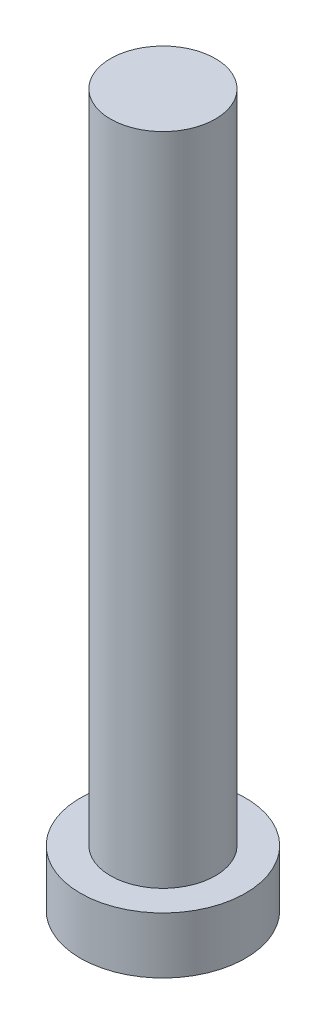
ISO-10303-21;
HEADER;
FILE_DESCRIPTION(('STEP AP214'),'2;1');
FILE_NAME('part.step','',(''),(''),'','','');
FILE_SCHEMA(('AUTOMOTIVE_DESIGN { 1 0 10303 214 1 1 1 1 }'));
ENDSEC;
DATA;
#1=APPLICATION_CONTEXT('core data for automotive mechanical design processes');
#2=APPLICATION_PROTOCOL_DEFINITION('international standard','automotive_design',2000,#1);
#3=PRODUCT_CONTEXT('',#1,'mechanical');
#4=PRODUCT('Part','Part','',(#3));
#5=PRODUCT_RELATED_PRODUCT_CATEGORY('part','',(#4));
#6=PRODUCT_DEFINITION_FORMATION('','',#4);
#7=PRODUCT_DEFINITION_CONTEXT('part definition',#1,'design');
#8=PRODUCT_DEFINITION('design','',#6,#7);
#9=PRODUCT_DEFINITION_SHAPE('','',#8);
#10=(LENGTH_UNIT() NAMED_UNIT(*) SI_UNIT(.MILLI.,.METRE.));
#11=(NAMED_UNIT(*) PLANE_ANGLE_UNIT() SI_UNIT($,.RADIAN.));
#12=(NAMED_UNIT(*) SI_UNIT($,.STERADIAN.) SOLID_ANGLE_UNIT());
#13=UNCERTAINTY_MEASURE_WITH_UNIT(LENGTH_MEASURE(1.E-05),#10,'distance_accuracy_value','');
#14=(GEOMETRIC_REPRESENTATION_CONTEXT(3) GLOBAL_UNCERTAINTY_ASSIGNED_CONTEXT((#13)) GLOBAL_UNIT_ASSIGNED_CONTEXT((#10,
#11,#12)) REPRESENTATION_CONTEXT('',''));
#15=CARTESIAN_POINT('',(0.,0.,0.));
#16=DIRECTION('',(0.,0.,1.));
#17=DIRECTION('',(1.,0.,0.));
#18=AXIS2_PLACEMENT_3D('',#15,#16,#17);
#19=CARTESIAN_POINT('',(0.,0.,0.));
#20=DIRECTION('',(0.,1.,0.));
#21=DIRECTION('',(0.,0.,1.));
#22=AXIS2_PLACEMENT_3D('',#19,#20,#21);
#23=PLANE('',#22);
#24=CARTESIAN_POINT('',(0.,0.,0.));
#25=DIRECTION('',(0.,1.,0.));
#26=DIRECTION('',(0.,0.,1.));
#27=AXIS2_PLACEMENT_3D('',#24,#25,#26);
#28=CIRCLE('',#27,3.15);
#29=CARTESIAN_POINT('',(0.,0.,3.15));
#30=VERTEX_POINT('',#29);
#31=EDGE_CURVE('E39',#30,#30,#28,.T.);
#32=ORIENTED_EDGE('',*,*,#31,.F.);
#33=EDGE_LOOP('',(#32));
#34=FACE_BOUND('',#33,.T.);
#35=CARTESIAN_POINT('',(1.,0.,1.));
#36=DIRECTION('',(0.,1.,0.));
#37=DIRECTION('',(0.,0.,-1.));
#38=AXIS2_PLACEMENT_3D('',#35,#36,#37);
#39=CIRCLE('',#38,0.5);
#40=CARTESIAN_POINT('',(1.,0.,0.5));
#41=VERTEX_POINT('',#40);
#42=CARTESIAN_POINT('',(0.5,0.,1.));
#43=VERTEX_POINT('',#42);
#44=EDGE_CURVE('E186',#41,#43,#39,.T.);
#45=ORIENTED_EDGE('',*,*,#44,.F.);
#46=DIRECTION('',(-1.,0.,0.));
#47=VECTOR('',#46,1.);
#48=CARTESIAN_POINT('',(1.,0.,0.5));
#49=LINE('',#48,#47);
#50=CARTESIAN_POINT('',(2.,0.,0.5));
#51=VERTEX_POINT('',#50);
#52=EDGE_CURVE('E52',#51,#41,#49,.T.);
#53=ORIENTED_EDGE('',*,*,#52,.F.);
#54=DIRECTION('',(0.,0.,1.));
#55=VECTOR('',#54,1.);
#56=CARTESIAN_POINT('',(2.,0.,-0.5));
#57=LINE('',#56,#55);
#58=CARTESIAN_POINT('',(2.,0.,-0.5));
#59=VERTEX_POINT('',#58);
#60=EDGE_CURVE('E225',#59,#51,#57,.T.);
#61=ORIENTED_EDGE('',*,*,#60,.F.);
#62=DIRECTION('',(1.,0.,0.));
#63=VECTOR('',#62,1.);
#64=CARTESIAN_POINT('',(1.,0.,-0.5));
#65=LINE('',#64,#63);
#66=CARTESIAN_POINT('',(1.,0.,-0.5));
#67=VERTEX_POINT('',#66);
#68=EDGE_CURVE('E223',#67,#59,#65,.T.);
#69=ORIENTED_EDGE('',*,*,#68,.F.);
#70=CARTESIAN_POINT('',(1.,0.,-1.));
#71=DIRECTION('',(0.,1.,0.));
#72=DIRECTION('',(0.,0.,-1.));
#73=AXIS2_PLACEMENT_3D('',#70,#71,#72);
#74=CIRCLE('',#73,0.5);
#75=CARTESIAN_POINT('',(0.500000000000001,0.,-1.));
#76=VERTEX_POINT('',#75);
#77=EDGE_CURVE('E160',#76,#67,#74,.T.);
#78=ORIENTED_EDGE('',*,*,#77,.F.);
#79=DIRECTION('',(0.,0.,1.));
#80=VECTOR('',#79,1.);
#81=CARTESIAN_POINT('',(0.500000000000001,0.,-2.));
#82=LINE('',#81,#80);
#83=CARTESIAN_POINT('',(0.500000000000001,0.,-2.));
#84=VERTEX_POINT('',#83);
#85=EDGE_CURVE('E219',#84,#76,#82,.T.);
#86=ORIENTED_EDGE('',*,*,#85,.F.);
#87=DIRECTION('',(1.,0.,0.));
#88=VECTOR('',#87,1.);
#89=CARTESIAN_POINT('',(-0.5,0.,-2.));
#90=LINE('',#89,#88);
#91=CARTESIAN_POINT('',(-0.5,0.,-2.));
#92=VERTEX_POINT('',#91);
#93=EDGE_CURVE('E216',#92,#84,#90,.T.);
#94=ORIENTED_EDGE('',*,*,#93,.F.);
#95=DIRECTION('',(0.,0.,-1.));
#96=VECTOR('',#95,1.);
#97=CARTESIAN_POINT('',(-0.5,0.,-2.));
#98=LINE('',#97,#96);
#99=CARTESIAN_POINT('',(-0.5,0.,-1.));
#100=VERTEX_POINT('',#99);
#101=EDGE_CURVE('E213',#100,#92,#98,.T.);
#102=ORIENTED_EDGE('',*,*,#101,.F.);
#103=CARTESIAN_POINT('',(-1.,0.,-1.));
#104=DIRECTION('',(0.,1.,0.));
#105=DIRECTION('',(0.,0.,-1.));
#106=AXIS2_PLACEMENT_3D('',#103,#104,#105);
#107=CIRCLE('',#106,0.5);
#108=CARTESIAN_POINT('',(-1.,0.,-0.5));
#109=VERTEX_POINT('',#108);
#110=EDGE_CURVE('E210',#109,#100,#107,.T.);
#111=ORIENTED_EDGE('',*,*,#110,.F.);
#112=DIRECTION('',(1.,0.,0.));
#113=VECTOR('',#112,1.);
#114=CARTESIAN_POINT('',(-2.,0.,-0.5));
#115=LINE('',#114,#113);
#116=CARTESIAN_POINT('',(-2.,0.,-0.5));
#117=VERTEX_POINT('',#116);
#118=EDGE_CURVE('E207',#117,#109,#115,.T.);
#119=ORIENTED_EDGE('',*,*,#118,.F.);
#120=DIRECTION('',(0.,0.,-1.));
#121=VECTOR('',#120,1.);
#122=CARTESIAN_POINT('',(-2.,0.,-0.5));
#123=LINE('',#122,#121);
#124=CARTESIAN_POINT('',(-2.,0.,0.5));
#125=VERTEX_POINT('',#124);
#126=EDGE_CURVE('E204',#125,#117,#123,.T.);
#127=ORIENTED_EDGE('',*,*,#126,.F.);
#128=DIRECTION('',(-1.,0.,0.));
#129=VECTOR('',#128,1.);
#130=CARTESIAN_POINT('',(-2.,0.,0.5));
#131=LINE('',#130,#129);
#132=CARTESIAN_POINT('',(-1.,0.,0.5));
#133=VERTEX_POINT('',#132);
#134=EDGE_CURVE('E201',#133,#125,#131,.T.);
#135=ORIENTED_EDGE('',*,*,#134,.F.);
#136=CARTESIAN_POINT('',(-1.,0.,1.));
#137=DIRECTION('',(0.,1.,0.));
#138=DIRECTION('',(0.,0.,1.));
#139=AXIS2_PLACEMENT_3D('',#136,#137,#138);
#140=CIRCLE('',#139,0.5);
#141=CARTESIAN_POINT('',(-0.5,0.,1.));
#142=VERTEX_POINT('',#141);
#143=EDGE_CURVE('E198',#142,#133,#140,.T.);
#144=ORIENTED_EDGE('',*,*,#143,.F.);
#145=DIRECTION('',(0.,0.,-1.));
#146=VECTOR('',#145,1.);
#147=CARTESIAN_POINT('',(-0.5,0.,1.));
#148=LINE('',#147,#146);
#149=CARTESIAN_POINT('',(-0.5,0.,2.));
#150=VERTEX_POINT('',#149);
#151=EDGE_CURVE('E195',#150,#142,#148,.T.);
#152=ORIENTED_EDGE('',*,*,#151,.F.);
#153=DIRECTION('',(-1.,0.,0.));
#154=VECTOR('',#153,1.);
#155=CARTESIAN_POINT('',(-0.5,0.,2.));
#156=LINE('',#155,#154);
#157=CARTESIAN_POINT('',(0.500000000000001,0.,2.));
#158=VERTEX_POINT('',#157);
#159=EDGE_CURVE('E192',#158,#150,#156,.T.);
#160=ORIENTED_EDGE('',*,*,#159,.F.);
#161=DIRECTION('',(0.,0.,1.));
#162=VECTOR('',#161,1.);
#163=CARTESIAN_POINT('',(0.5,0.,1.));
#164=LINE('',#163,#162);
#165=EDGE_CURVE('E189',#43,#158,#164,.T.);
#166=ORIENTED_EDGE('',*,*,#165,.F.);
#167=EDGE_LOOP('',(#45,#53,#61,#69,#78,#86,#94,#102,#111,#119,#127,#135,#144,#152,#160,#166));
#168=FACE_BOUND('',#167,.T.);
#169=ADVANCED_FACE('F35',(#34,#168),#23,.F.);
#170=CARTESIAN_POINT('',(0.,2.15,0.));
#171=DIRECTION('',(0.,-1.,0.));
#172=DIRECTION('',(0.,0.,-1.));
#173=AXIS2_PLACEMENT_3D('',#170,#171,#172);
#174=CYLINDRICAL_SURFACE('',#173,3.15);
#175=CARTESIAN_POINT('',(0.,2.15,0.));
#176=DIRECTION('',(0.,1.,0.));
#177=DIRECTION('',(0.,0.,1.));
#178=AXIS2_PLACEMENT_3D('',#175,#176,#177);
#179=CIRCLE('',#178,3.15);
#180=CARTESIAN_POINT('',(0.,2.15,3.15));
#181=VERTEX_POINT('',#180);
#182=EDGE_CURVE('E44',#181,#181,#179,.T.);
#183=ORIENTED_EDGE('',*,*,#182,.F.);
#184=EDGE_LOOP('',(#183));
#185=FACE_BOUND('',#184,.T.);
#186=ORIENTED_EDGE('',*,*,#31,.T.);
#187=EDGE_LOOP('',(#186));
#188=FACE_BOUND('',#187,.T.);
#189=ADVANCED_FACE('F37',(#185,#188),#174,.T.);
#190=CARTESIAN_POINT('',(0.,2.15,0.));
#191=DIRECTION('',(0.,1.,0.));
#192=DIRECTION('',(0.,0.,1.));
#193=AXIS2_PLACEMENT_3D('',#190,#191,#192);
#194=PLANE('',#193);
#195=CARTESIAN_POINT('',(0.,2.15,0.));
#196=DIRECTION('',(0.,1.,0.));
#197=DIRECTION('',(0.,0.,1.));
#198=AXIS2_PLACEMENT_3D('',#195,#196,#197);
#199=CIRCLE('',#198,2.);
#200=CARTESIAN_POINT('',(0.,2.15,2.));
#201=VERTEX_POINT('',#200);
#202=EDGE_CURVE('E11',#201,#201,#199,.T.);
#203=ORIENTED_EDGE('',*,*,#202,.F.);
#204=EDGE_LOOP('',(#203));
#205=FACE_BOUND('',#204,.T.);
#206=ORIENTED_EDGE('',*,*,#182,.T.);
#207=EDGE_LOOP('',(#206));
#208=FACE_BOUND('',#207,.T.);
#209=ADVANCED_FACE('F374',(#205,#208),#194,.T.);
#210=CARTESIAN_POINT('',(0.,27.15,0.));
#211=DIRECTION('',(0.,-1.,0.));
#212=DIRECTION('',(0.,0.,-1.));
#213=AXIS2_PLACEMENT_3D('',#210,#211,#212);
#214=CYLINDRICAL_SURFACE('',#213,2.);
#215=CARTESIAN_POINT('',(0.,27.15,0.));
#216=DIRECTION('',(0.,1.,0.));
#217=DIRECTION('',(0.,0.,1.));
#218=AXIS2_PLACEMENT_3D('',#215,#216,#217);
#219=CIRCLE('',#218,2.);
#220=CARTESIAN_POINT('',(0.,27.15,2.));
#221=VERTEX_POINT('',#220);
#222=EDGE_CURVE('E229',#221,#221,#219,.T.);
#223=ORIENTED_EDGE('',*,*,#222,.F.);
#224=EDGE_LOOP('',(#223));
#225=FACE_BOUND('',#224,.T.);
#226=ORIENTED_EDGE('',*,*,#202,.T.);
#227=EDGE_LOOP('',(#226));
#228=FACE_BOUND('',#227,.T.);
#229=ADVANCED_FACE('F370',(#225,#228),#214,.T.);
#230=CARTESIAN_POINT('',(0.,27.15,0.));
#231=DIRECTION('',(0.,1.,0.));
#232=DIRECTION('',(0.,0.,1.));
#233=AXIS2_PLACEMENT_3D('',#230,#231,#232);
#234=PLANE('',#233);
#235=ORIENTED_EDGE('',*,*,#222,.T.);
#236=EDGE_LOOP('',(#235));
#237=FACE_BOUND('',#236,.T.);
#238=ADVANCED_FACE('F320',(#237),#234,.T.);
#239=CARTESIAN_POINT('',(1.,1.5,0.5));
#240=DIRECTION('',(0.,0.,1.));
#241=DIRECTION('',(1.,0.,0.));
#242=AXIS2_PLACEMENT_3D('',#239,#240,#241);
#243=PLANE('',#242);
#244=ORIENTED_EDGE('',*,*,#52,.T.);
#245=DIRECTION('',(0.,-1.,0.));
#246=VECTOR('',#245,1.);
#247=CARTESIAN_POINT('',(1.,1.5,0.5));
#248=LINE('',#247,#246);
#249=CARTESIAN_POINT('',(1.,1.5,0.5));
#250=VERTEX_POINT('',#249);
#251=EDGE_CURVE('E112',#250,#41,#248,.T.);
#252=ORIENTED_EDGE('',*,*,#251,.F.);
#253=DIRECTION('',(-1.,0.,0.));
#254=VECTOR('',#253,1.);
#255=CARTESIAN_POINT('',(1.,1.5,0.5));
#256=LINE('',#255,#254);
#257=CARTESIAN_POINT('',(2.,1.5,0.5));
#258=VERTEX_POINT('',#257);
#259=EDGE_CURVE('E227',#258,#250,#256,.T.);
#260=ORIENTED_EDGE('',*,*,#259,.F.);
#261=DIRECTION('',(0.,-1.,0.));
#262=VECTOR('',#261,1.);
#263=CARTESIAN_POINT('',(2.,1.5,0.5));
#264=LINE('',#263,#262);
#265=EDGE_CURVE('E60',#258,#51,#264,.T.);
#266=ORIENTED_EDGE('',*,*,#265,.T.);
#267=EDGE_LOOP('',(#244,#252,#260,#266));
#268=FACE_BOUND('',#267,.T.);
#269=ADVANCED_FACE('F313',(#268),#243,.F.);
#270=CARTESIAN_POINT('',(2.,1.5,-0.5));
#271=DIRECTION('',(1.,0.,0.));
#272=DIRECTION('',(0.,0.,-1.));
#273=AXIS2_PLACEMENT_3D('',#270,#271,#272);
#274=PLANE('',#273);
#275=ORIENTED_EDGE('',*,*,#60,.T.);
#276=ORIENTED_EDGE('',*,*,#265,.F.);
#277=DIRECTION('',(0.,0.,1.));
#278=VECTOR('',#277,1.);
#279=CARTESIAN_POINT('',(2.,1.5,-0.5));
#280=LINE('',#279,#278);
#281=CARTESIAN_POINT('',(2.,1.5,-0.5));
#282=VERTEX_POINT('',#281);
#283=EDGE_CURVE('E172',#282,#258,#280,.T.);
#284=ORIENTED_EDGE('',*,*,#283,.F.);
#285=DIRECTION('',(0.,-1.,0.));
#286=VECTOR('',#285,1.);
#287=CARTESIAN_POINT('',(2.,1.5,-0.5));
#288=LINE('',#287,#286);
#289=EDGE_CURVE('E164',#282,#59,#288,.T.);
#290=ORIENTED_EDGE('',*,*,#289,.T.);
#291=EDGE_LOOP('',(#275,#276,#284,#290));
#292=FACE_BOUND('',#291,.T.);
#293=ADVANCED_FACE('F311',(#292),#274,.F.);
#294=CARTESIAN_POINT('',(1.,1.5,-0.5));
#295=DIRECTION('',(0.,0.,-1.));
#296=DIRECTION('',(-1.,0.,0.));
#297=AXIS2_PLACEMENT_3D('',#294,#295,#296);
#298=PLANE('',#297);
#299=ORIENTED_EDGE('',*,*,#68,.T.);
#300=ORIENTED_EDGE('',*,*,#289,.F.);
#301=DIRECTION('',(1.,0.,0.));
#302=VECTOR('',#301,1.);
#303=CARTESIAN_POINT('',(1.,1.5,-0.5));
#304=LINE('',#303,#302);
#305=CARTESIAN_POINT('',(1.,1.5,-0.5));
#306=VERTEX_POINT('',#305);
#307=EDGE_CURVE('E168',#306,#282,#304,.T.);
#308=ORIENTED_EDGE('',*,*,#307,.F.);
#309=DIRECTION('',(0.,-1.,0.));
#310=VECTOR('',#309,1.);
#311=CARTESIAN_POINT('',(1.,1.5,-0.5));
#312=LINE('',#311,#310);
#313=EDGE_CURVE('E153',#306,#67,#312,.T.);
#314=ORIENTED_EDGE('',*,*,#313,.T.);
#315=EDGE_LOOP('',(#299,#300,#308,#314));
#316=FACE_BOUND('',#315,.T.);
#317=ADVANCED_FACE('F169',(#316),#298,.F.);
#318=CARTESIAN_POINT('',(1.,1.5,-1.));
#319=DIRECTION('',(0.,-1.,0.));
#320=DIRECTION('',(0.,0.,-1.));
#321=AXIS2_PLACEMENT_3D('',#318,#319,#320);
#322=CYLINDRICAL_SURFACE('',#321,0.5);
#323=ORIENTED_EDGE('',*,*,#77,.T.);
#324=ORIENTED_EDGE('',*,*,#313,.F.);
#325=CARTESIAN_POINT('',(1.,1.5,-1.));
#326=DIRECTION('',(0.,1.,0.));
#327=DIRECTION('',(0.,0.,-1.));
#328=AXIS2_PLACEMENT_3D('',#325,#326,#327);
#329=CIRCLE('',#328,0.5);
#330=CARTESIAN_POINT('',(0.500000000000001,1.5,-1.));
#331=VERTEX_POINT('',#330);
#332=EDGE_CURVE('E157',#331,#306,#329,.T.);
#333=ORIENTED_EDGE('',*,*,#332,.F.);
#334=DIRECTION('',(0.,-1.,0.));
#335=VECTOR('',#334,1.);
#336=CARTESIAN_POINT('',(0.500000000000001,1.5,-1.));
#337=LINE('',#336,#335);
#338=EDGE_CURVE('E165',#331,#76,#337,.T.);
#339=ORIENTED_EDGE('',*,*,#338,.T.);
#340=EDGE_LOOP('',(#323,#324,#333,#339));
#341=FACE_BOUND('',#340,.T.);
#342=ADVANCED_FACE('F155',(#341),#322,.T.);
#343=CARTESIAN_POINT('',(0.500000000000001,1.5,-2.));
#344=DIRECTION('',(1.,0.,0.));
#345=DIRECTION('',(0.,0.,-1.));
#346=AXIS2_PLACEMENT_3D('',#343,#344,#345);
#347=PLANE('',#346);
#348=ORIENTED_EDGE('',*,*,#85,.T.);
#349=ORIENTED_EDGE('',*,*,#338,.F.);
#350=DIRECTION('',(0.,0.,1.));
#351=VECTOR('',#350,1.);
#352=CARTESIAN_POINT('',(0.500000000000001,1.5,-2.));
#353=LINE('',#352,#351);
#354=CARTESIAN_POINT('',(0.500000000000001,1.5,-2.));
#355=VERTEX_POINT('',#354);
#356=EDGE_CURVE('E178',#355,#331,#353,.T.);
#357=ORIENTED_EDGE('',*,*,#356,.F.);
#358=DIRECTION('',(0.,-1.,0.));
#359=VECTOR('',#358,1.);
#360=CARTESIAN_POINT('',(0.500000000000001,1.5,-2.));
#361=LINE('',#360,#359);
#362=EDGE_CURVE('E232',#355,#84,#361,.T.);
#363=ORIENTED_EDGE('',*,*,#362,.T.);
#364=EDGE_LOOP('',(#348,#349,#357,#363));
#365=FACE_BOUND('',#364,.T.);
#366=ADVANCED_FACE('F310',(#365),#347,.F.);
#367=CARTESIAN_POINT('',(-0.5,1.5,-2.));
#368=DIRECTION('',(0.,0.,-1.));
#369=DIRECTION('',(-1.,0.,0.));
#370=AXIS2_PLACEMENT_3D('',#367,#368,#369);
#371=PLANE('',#370);
#372=ORIENTED_EDGE('',*,*,#93,.T.);
#373=ORIENTED_EDGE('',*,*,#362,.F.);
#374=DIRECTION('',(1.,0.,0.));
#375=VECTOR('',#374,1.);
#376=CARTESIAN_POINT('',(-0.5,1.5,-2.));
#377=LINE('',#376,#375);
#378=CARTESIAN_POINT('',(-0.5,1.5,-2.));
#379=VERTEX_POINT('',#378);
#380=EDGE_CURVE('E180',#379,#355,#377,.T.);
#381=ORIENTED_EDGE('',*,*,#380,.F.);
#382=DIRECTION('',(0.,-1.,0.));
#383=VECTOR('',#382,1.);
#384=CARTESIAN_POINT('',(-0.5,1.5,-2.));
#385=LINE('',#384,#383);
#386=EDGE_CURVE('E234',#379,#92,#385,.T.);
#387=ORIENTED_EDGE('',*,*,#386,.T.);
#388=EDGE_LOOP('',(#372,#373,#381,#387));
#389=FACE_BOUND('',#388,.T.);
#390=ADVANCED_FACE('F306',(#389),#371,.F.);
#391=CARTESIAN_POINT('',(-0.5,1.5,-2.));
#392=DIRECTION('',(-1.,0.,0.));
#393=DIRECTION('',(0.,0.,1.));
#394=AXIS2_PLACEMENT_3D('',#391,#392,#393);
#395=PLANE('',#394);
#396=ORIENTED_EDGE('',*,*,#101,.T.);
#397=ORIENTED_EDGE('',*,*,#386,.F.);
#398=DIRECTION('',(0.,0.,-1.));
#399=VECTOR('',#398,1.);
#400=CARTESIAN_POINT('',(-0.5,1.5,-2.));
#401=LINE('',#400,#399);
#402=CARTESIAN_POINT('',(-0.5,1.5,-1.));
#403=VERTEX_POINT('',#402);
#404=EDGE_CURVE('E301',#403,#379,#401,.T.);
#405=ORIENTED_EDGE('',*,*,#404,.F.);
#406=DIRECTION('',(0.,-1.,0.));
#407=VECTOR('',#406,1.);
#408=CARTESIAN_POINT('',(-0.5,1.5,-1.));
#409=LINE('',#408,#407);
#410=EDGE_CURVE('E236',#403,#100,#409,.T.);
#411=ORIENTED_EDGE('',*,*,#410,.T.);
#412=EDGE_LOOP('',(#396,#397,#405,#411));
#413=FACE_BOUND('',#412,.T.);
#414=ADVANCED_FACE('F330',(#413),#395,.F.);
#415=CARTESIAN_POINT('',(-1.,1.5,-1.));
#416=DIRECTION('',(0.,-1.,0.));
#417=DIRECTION('',(0.,0.,-1.));
#418=AXIS2_PLACEMENT_3D('',#415,#416,#417);
#419=CYLINDRICAL_SURFACE('',#418,0.5);
#420=ORIENTED_EDGE('',*,*,#110,.T.);
#421=ORIENTED_EDGE('',*,*,#410,.F.);
#422=CARTESIAN_POINT('',(-1.,1.5,-1.));
#423=DIRECTION('',(0.,1.,0.));
#424=DIRECTION('',(0.,0.,-1.));
#425=AXIS2_PLACEMENT_3D('',#422,#423,#424);
#426=CIRCLE('',#425,0.5);
#427=CARTESIAN_POINT('',(-1.,1.5,-0.5));
#428=VERTEX_POINT('',#427);
#429=EDGE_CURVE('E298',#428,#403,#426,.T.);
#430=ORIENTED_EDGE('',*,*,#429,.F.);
#431=DIRECTION('',(0.,-1.,0.));
#432=VECTOR('',#431,1.);
#433=CARTESIAN_POINT('',(-1.,1.5,-0.5));
#434=LINE('',#433,#432);
#435=EDGE_CURVE('E238',#428,#109,#434,.T.);
#436=ORIENTED_EDGE('',*,*,#435,.T.);
#437=EDGE_LOOP('',(#420,#421,#430,#436));
#438=FACE_BOUND('',#437,.T.);
#439=ADVANCED_FACE('F333',(#438),#419,.T.);
#440=CARTESIAN_POINT('',(-2.,1.5,-0.5));
#441=DIRECTION('',(0.,0.,-1.));
#442=DIRECTION('',(-1.,0.,0.));
#443=AXIS2_PLACEMENT_3D('',#440,#441,#442);
#444=PLANE('',#443);
#445=ORIENTED_EDGE('',*,*,#118,.T.);
#446=ORIENTED_EDGE('',*,*,#435,.F.);
#447=DIRECTION('',(1.,0.,0.));
#448=VECTOR('',#447,1.);
#449=CARTESIAN_POINT('',(-2.,1.5,-0.5));
#450=LINE('',#449,#448);
#451=CARTESIAN_POINT('',(-2.,1.5,-0.5));
#452=VERTEX_POINT('',#451);
#453=EDGE_CURVE('E295',#452,#428,#450,.T.);
#454=ORIENTED_EDGE('',*,*,#453,.F.);
#455=DIRECTION('',(0.,-1.,0.));
#456=VECTOR('',#455,1.);
#457=CARTESIAN_POINT('',(-2.,1.5,-0.5));
#458=LINE('',#457,#456);
#459=EDGE_CURVE('E240',#452,#117,#458,.T.);
#460=ORIENTED_EDGE('',*,*,#459,.T.);
#461=EDGE_LOOP('',(#445,#446,#454,#460));
#462=FACE_BOUND('',#461,.T.);
#463=ADVANCED_FACE('F337',(#462),#444,.F.);
#464=CARTESIAN_POINT('',(-2.,1.5,-0.5));
#465=DIRECTION('',(-1.,0.,0.));
#466=DIRECTION('',(0.,0.,1.));
#467=AXIS2_PLACEMENT_3D('',#464,#465,#466);
#468=PLANE('',#467);
#469=ORIENTED_EDGE('',*,*,#126,.T.);
#470=ORIENTED_EDGE('',*,*,#459,.F.);
#471=DIRECTION('',(0.,0.,-1.));
#472=VECTOR('',#471,1.);
#473=CARTESIAN_POINT('',(-2.,1.5,-0.5));
#474=LINE('',#473,#472);
#475=CARTESIAN_POINT('',(-2.,1.5,0.5));
#476=VERTEX_POINT('',#475);
#477=EDGE_CURVE('E292',#476,#452,#474,.T.);
#478=ORIENTED_EDGE('',*,*,#477,.F.);
#479=DIRECTION('',(0.,-1.,0.));
#480=VECTOR('',#479,1.);
#481=CARTESIAN_POINT('',(-2.,1.5,0.5));
#482=LINE('',#481,#480);
#483=EDGE_CURVE('E242',#476,#125,#482,.T.);
#484=ORIENTED_EDGE('',*,*,#483,.T.);
#485=EDGE_LOOP('',(#469,#470,#478,#484));
#486=FACE_BOUND('',#485,.T.);
#487=ADVANCED_FACE('F341',(#486),#468,.F.);
#488=CARTESIAN_POINT('',(-2.,1.5,0.5));
#489=DIRECTION('',(0.,0.,1.));
#490=DIRECTION('',(1.,0.,0.));
#491=AXIS2_PLACEMENT_3D('',#488,#489,#490);
#492=PLANE('',#491);
#493=ORIENTED_EDGE('',*,*,#134,.T.);
#494=ORIENTED_EDGE('',*,*,#483,.F.);
#495=DIRECTION('',(-1.,0.,0.));
#496=VECTOR('',#495,1.);
#497=CARTESIAN_POINT('',(-2.,1.5,0.5));
#498=LINE('',#497,#496);
#499=CARTESIAN_POINT('',(-1.,1.5,0.5));
#500=VERTEX_POINT('',#499);
#501=EDGE_CURVE('E289',#500,#476,#498,.T.);
#502=ORIENTED_EDGE('',*,*,#501,.F.);
#503=DIRECTION('',(0.,-1.,0.));
#504=VECTOR('',#503,1.);
#505=CARTESIAN_POINT('',(-1.,1.5,0.5));
#506=LINE('',#505,#504);
#507=EDGE_CURVE('E244',#500,#133,#506,.T.);
#508=ORIENTED_EDGE('',*,*,#507,.T.);
#509=EDGE_LOOP('',(#493,#494,#502,#508));
#510=FACE_BOUND('',#509,.T.);
#511=ADVANCED_FACE('F345',(#510),#492,.F.);
#512=CARTESIAN_POINT('',(-1.,1.5,1.));
#513=DIRECTION('',(0.,-1.,0.));
#514=DIRECTION('',(0.,0.,-1.));
#515=AXIS2_PLACEMENT_3D('',#512,#513,#514);
#516=CYLINDRICAL_SURFACE('',#515,0.5);
#517=ORIENTED_EDGE('',*,*,#143,.T.);
#518=ORIENTED_EDGE('',*,*,#507,.F.);
#519=CARTESIAN_POINT('',(-1.,1.5,1.));
#520=DIRECTION('',(0.,1.,0.));
#521=DIRECTION('',(0.,0.,1.));
#522=AXIS2_PLACEMENT_3D('',#519,#520,#521);
#523=CIRCLE('',#522,0.5);
#524=CARTESIAN_POINT('',(-0.5,1.5,1.));
#525=VERTEX_POINT('',#524);
#526=EDGE_CURVE('E286',#525,#500,#523,.T.);
#527=ORIENTED_EDGE('',*,*,#526,.F.);
#528=DIRECTION('',(0.,-1.,0.));
#529=VECTOR('',#528,1.);
#530=CARTESIAN_POINT('',(-0.5,1.5,1.));
#531=LINE('',#530,#529);
#532=EDGE_CURVE('E246',#525,#142,#531,.T.);
#533=ORIENTED_EDGE('',*,*,#532,.T.);
#534=EDGE_LOOP('',(#517,#518,#527,#533));
#535=FACE_BOUND('',#534,.T.);
#536=ADVANCED_FACE('F349',(#535),#516,.T.);
#537=CARTESIAN_POINT('',(-0.5,1.5,1.));
#538=DIRECTION('',(-1.,0.,0.));
#539=DIRECTION('',(0.,0.,1.));
#540=AXIS2_PLACEMENT_3D('',#537,#538,#539);
#541=PLANE('',#540);
#542=ORIENTED_EDGE('',*,*,#151,.T.);
#543=ORIENTED_EDGE('',*,*,#532,.F.);
#544=DIRECTION('',(0.,0.,-1.));
#545=VECTOR('',#544,1.);
#546=CARTESIAN_POINT('',(-0.5,1.5,1.));
#547=LINE('',#546,#545);
#548=CARTESIAN_POINT('',(-0.5,1.5,2.));
#549=VERTEX_POINT('',#548);
#550=EDGE_CURVE('E283',#549,#525,#547,.T.);
#551=ORIENTED_EDGE('',*,*,#550,.F.);
#552=DIRECTION('',(0.,-1.,0.));
#553=VECTOR('',#552,1.);
#554=CARTESIAN_POINT('',(-0.5,1.5,2.));
#555=LINE('',#554,#553);
#556=EDGE_CURVE('E248',#549,#150,#555,.T.);
#557=ORIENTED_EDGE('',*,*,#556,.T.);
#558=EDGE_LOOP('',(#542,#543,#551,#557));
#559=FACE_BOUND('',#558,.T.);
#560=ADVANCED_FACE('F353',(#559),#541,.F.);
#561=CARTESIAN_POINT('',(-0.5,1.5,2.));
#562=DIRECTION('',(0.,0.,1.));
#563=DIRECTION('',(1.,0.,0.));
#564=AXIS2_PLACEMENT_3D('',#561,#562,#563);
#565=PLANE('',#564);
#566=ORIENTED_EDGE('',*,*,#159,.T.);
#567=ORIENTED_EDGE('',*,*,#556,.F.);
#568=DIRECTION('',(-1.,0.,0.));
#569=VECTOR('',#568,1.);
#570=CARTESIAN_POINT('',(-0.5,1.5,2.));
#571=LINE('',#570,#569);
#572=CARTESIAN_POINT('',(0.500000000000001,1.5,2.));
#573=VERTEX_POINT('',#572);
#574=EDGE_CURVE('E280',#573,#549,#571,.T.);
#575=ORIENTED_EDGE('',*,*,#574,.F.);
#576=DIRECTION('',(0.,-1.,0.));
#577=VECTOR('',#576,1.);
#578=CARTESIAN_POINT('',(0.500000000000001,1.5,2.));
#579=LINE('',#578,#577);
#580=EDGE_CURVE('E250',#573,#158,#579,.T.);
#581=ORIENTED_EDGE('',*,*,#580,.T.);
#582=EDGE_LOOP('',(#566,#567,#575,#581));
#583=FACE_BOUND('',#582,.T.);
#584=ADVANCED_FACE('F357',(#583),#565,.F.);
#585=CARTESIAN_POINT('',(0.5,1.5,1.));
#586=DIRECTION('',(1.,0.,0.));
#587=DIRECTION('',(0.,0.,-1.));
#588=AXIS2_PLACEMENT_3D('',#585,#586,#587);
#589=PLANE('',#588);
#590=ORIENTED_EDGE('',*,*,#165,.T.);
#591=ORIENTED_EDGE('',*,*,#580,.F.);
#592=DIRECTION('',(0.,0.,1.));
#593=VECTOR('',#592,1.);
#594=CARTESIAN_POINT('',(0.5,1.5,1.));
#595=LINE('',#594,#593);
#596=CARTESIAN_POINT('',(0.5,1.5,1.));
#597=VERTEX_POINT('',#596);
#598=EDGE_CURVE('E275',#597,#573,#595,.T.);
#599=ORIENTED_EDGE('',*,*,#598,.F.);
#600=DIRECTION('',(0.,-1.,0.));
#601=VECTOR('',#600,1.);
#602=CARTESIAN_POINT('',(0.5,1.5,1.));
#603=LINE('',#602,#601);
#604=EDGE_CURVE('E252',#597,#43,#603,.T.);
#605=ORIENTED_EDGE('',*,*,#604,.T.);
#606=EDGE_LOOP('',(#590,#591,#599,#605));
#607=FACE_BOUND('',#606,.T.);
#608=ADVANCED_FACE('F361',(#607),#589,.F.);
#609=CARTESIAN_POINT('',(1.,1.5,1.));
#610=DIRECTION('',(0.,-1.,0.));
#611=DIRECTION('',(0.,0.,-1.));
#612=AXIS2_PLACEMENT_3D('',#609,#610,#611);
#613=CYLINDRICAL_SURFACE('',#612,0.5);
#614=ORIENTED_EDGE('',*,*,#44,.T.);
#615=ORIENTED_EDGE('',*,*,#604,.F.);
#616=CARTESIAN_POINT('',(1.,1.5,1.));
#617=DIRECTION('',(0.,1.,0.));
#618=DIRECTION('',(0.,0.,-1.));
#619=AXIS2_PLACEMENT_3D('',#616,#617,#618);
#620=CIRCLE('',#619,0.5);
#621=EDGE_CURVE('E273',#250,#597,#620,.T.);
#622=ORIENTED_EDGE('',*,*,#621,.F.);
#623=ORIENTED_EDGE('',*,*,#251,.T.);
#624=EDGE_LOOP('',(#614,#615,#622,#623));
#625=FACE_BOUND('',#624,.T.);
#626=ADVANCED_FACE('F270',(#625),#613,.T.);
#627=CARTESIAN_POINT('',(1.,1.5,-1.));
#628=DIRECTION('',(0.,-1.,0.));
#629=DIRECTION('',(0.,0.,-1.));
#630=AXIS2_PLACEMENT_3D('',#627,#628,#629);
#631=PLANE('',#630);
#632=ORIENTED_EDGE('',*,*,#259,.T.);
#633=ORIENTED_EDGE('',*,*,#621,.T.);
#634=ORIENTED_EDGE('',*,*,#598,.T.);
#635=ORIENTED_EDGE('',*,*,#574,.T.);
#636=ORIENTED_EDGE('',*,*,#550,.T.);
#637=ORIENTED_EDGE('',*,*,#526,.T.);
#638=ORIENTED_EDGE('',*,*,#501,.T.);
#639=ORIENTED_EDGE('',*,*,#477,.T.);
#640=ORIENTED_EDGE('',*,*,#453,.T.);
#641=ORIENTED_EDGE('',*,*,#429,.T.);
#642=ORIENTED_EDGE('',*,*,#404,.T.);
#643=ORIENTED_EDGE('',*,*,#380,.T.);
#644=ORIENTED_EDGE('',*,*,#356,.T.);
#645=ORIENTED_EDGE('',*,*,#332,.T.);
#646=ORIENTED_EDGE('',*,*,#307,.T.);
#647=ORIENTED_EDGE('',*,*,#283,.T.);
#648=EDGE_LOOP('',(#632,#633,#634,#635,#636,#637,#638,#639,#640,#641,#642,#643,#644,#645,#646,#647));
#649=FACE_BOUND('',#648,.T.);
#650=ADVANCED_FACE('F175',(#649),#631,.T.);
#651=CLOSED_SHELL('',(#169,#189,#209,#229,#238,#269,#293,#317,#342,#366,#390,#414,#439,#463,
#487,#511,#536,#560,#584,#608,#626,#650));
#652=MANIFOLD_SOLID_BREP('B2',#651);
#653=ADVANCED_BREP_SHAPE_REPRESENTATION('',(#18,#652),#14);
#654=SHAPE_DEFINITION_REPRESENTATION(#9,#653);
ENDSEC;
END-ISO-10303-21;
